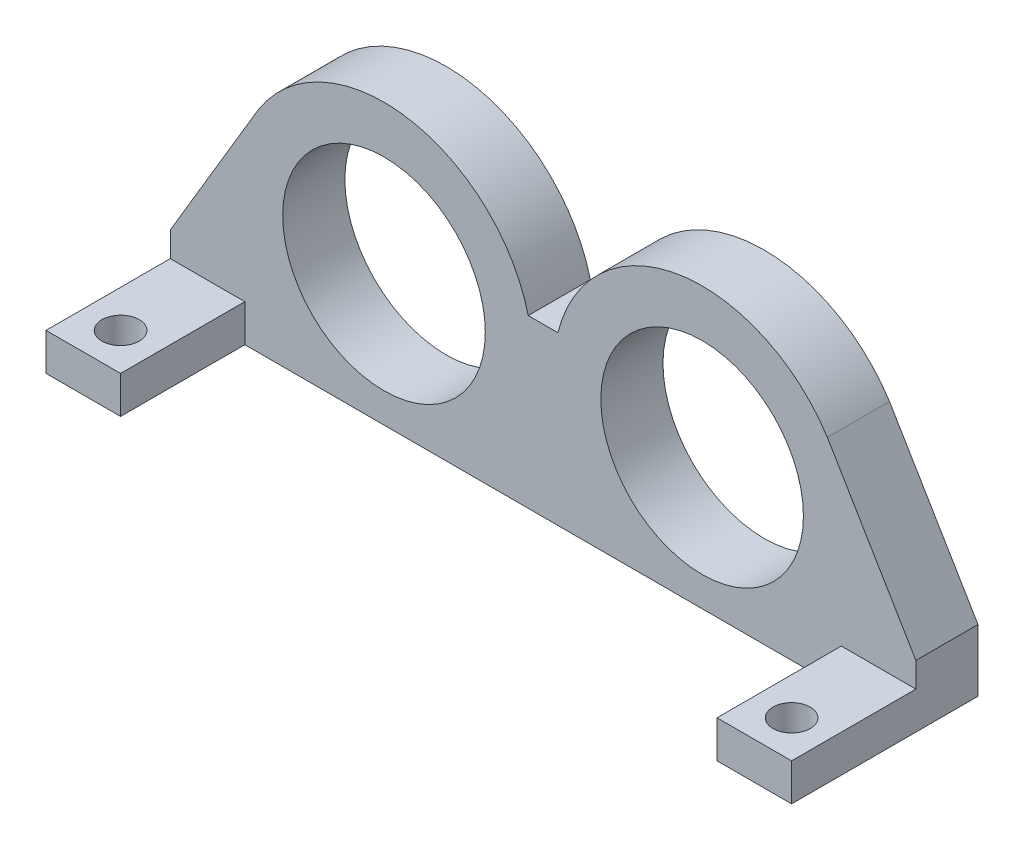
ISO-10303-21;
HEADER;
FILE_DESCRIPTION(('STEP AP214'),'2;1');
FILE_NAME('part.step','',(''),(''),'','','');
FILE_SCHEMA(('AUTOMOTIVE_DESIGN { 1 0 10303 214 1 1 1 1 }'));
ENDSEC;
DATA;
#1=APPLICATION_CONTEXT('core data for automotive mechanical design processes');
#2=APPLICATION_PROTOCOL_DEFINITION('international standard','automotive_design',2000,#1);
#3=PRODUCT_CONTEXT('',#1,'mechanical');
#4=PRODUCT('Part','Part','',(#3));
#5=PRODUCT_RELATED_PRODUCT_CATEGORY('part','',(#4));
#6=PRODUCT_DEFINITION_FORMATION('','',#4);
#7=PRODUCT_DEFINITION_CONTEXT('part definition',#1,'design');
#8=PRODUCT_DEFINITION('design','',#6,#7);
#9=PRODUCT_DEFINITION_SHAPE('','',#8);
#10=(LENGTH_UNIT() NAMED_UNIT(*) SI_UNIT(.MILLI.,.METRE.));
#11=(NAMED_UNIT(*) PLANE_ANGLE_UNIT() SI_UNIT($,.RADIAN.));
#12=(NAMED_UNIT(*) SI_UNIT($,.STERADIAN.) SOLID_ANGLE_UNIT());
#13=UNCERTAINTY_MEASURE_WITH_UNIT(LENGTH_MEASURE(1.E-05),#10,'distance_accuracy_value','');
#14=(GEOMETRIC_REPRESENTATION_CONTEXT(3) GLOBAL_UNCERTAINTY_ASSIGNED_CONTEXT((#13)) GLOBAL_UNIT_ASSIGNED_CONTEXT((#10,
#11,#12)) REPRESENTATION_CONTEXT('',''));
#15=CARTESIAN_POINT('',(0.,0.,0.));
#16=DIRECTION('',(0.,0.,1.));
#17=DIRECTION('',(1.,0.,0.));
#18=AXIS2_PLACEMENT_3D('',#15,#16,#17);
#19=CARTESIAN_POINT('',(-12.8,10.5397331653471,5.));
#20=DIRECTION('',(0.,0.,-1.));
#21=DIRECTION('',(-1.,0.,0.));
#22=AXIS2_PLACEMENT_3D('',#19,#20,#21);
#23=PLANE('',#22);
#24=CARTESIAN_POINT('',(-12.8,10.5397331653471,5.));
#25=DIRECTION('',(0.,0.,1.));
#26=DIRECTION('',(1.,0.,0.));
#27=AXIS2_PLACEMENT_3D('',#24,#25,#26);
#28=CIRCLE('',#27,8.15);
#29=CARTESIAN_POINT('',(-4.65,10.5397331653471,5.));
#30=VERTEX_POINT('',#29);
#31=EDGE_CURVE('E232',#30,#30,#28,.T.);
#32=ORIENTED_EDGE('',*,*,#31,.F.);
#33=EDGE_LOOP('',(#32));
#34=FACE_BOUND('',#33,.T.);
#35=CARTESIAN_POINT('',(12.8,10.5397331653471,5.));
#36=DIRECTION('',(0.,0.,1.));
#37=DIRECTION('',(-1.,0.,0.));
#38=AXIS2_PLACEMENT_3D('',#35,#36,#37);
#39=CIRCLE('',#38,8.15);
#40=CARTESIAN_POINT('',(4.65,10.5397331653471,5.));
#41=VERTEX_POINT('',#40);
#42=EDGE_CURVE('E224',#41,#41,#39,.T.);
#43=ORIENTED_EDGE('',*,*,#42,.F.);
#44=EDGE_LOOP('',(#43));
#45=FACE_BOUND('',#44,.T.);
#46=DIRECTION('',(-1.,0.,0.));
#47=VECTOR('',#46,1.);
#48=CARTESIAN_POINT('',(30.,2.99999999999999,5.));
#49=LINE('',#48,#47);
#50=CARTESIAN_POINT('',(30.,2.99999999999999,5.));
#51=VERTEX_POINT('',#50);
#52=CARTESIAN_POINT('',(24.,2.99999999999999,5.));
#53=VERTEX_POINT('',#52);
#54=EDGE_CURVE('E169',#51,#53,#49,.T.);
#55=ORIENTED_EDGE('',*,*,#54,.F.);
#56=DIRECTION('',(0.,1.,0.));
#57=VECTOR('',#56,1.);
#58=CARTESIAN_POINT('',(30.,0.,5.));
#59=LINE('',#58,#57);
#60=CARTESIAN_POINT('',(30.,5.,5.));
#61=VERTEX_POINT('',#60);
#62=EDGE_CURVE('E246',#51,#61,#59,.T.);
#63=ORIENTED_EDGE('',*,*,#62,.T.);
#64=DIRECTION('',(-0.510895863511002,0.859642609836988,0.));
#65=VECTOR('',#64,1.);
#66=CARTESIAN_POINT('',(30.,5.,5.));
#67=LINE('',#66,#65);
#68=CARTESIAN_POINT('',(22.877190337887,16.9849682188297,5.));
#69=VERTEX_POINT('',#68);
#70=EDGE_CURVE('E249',#61,#69,#67,.T.);
#71=ORIENTED_EDGE('',*,*,#70,.T.);
#72=CARTESIAN_POINT('',(12.8,10.5397331653471,5.));
#73=DIRECTION('',(0.,0.,1.));
#74=DIRECTION('',(1.,0.,0.));
#75=AXIS2_PLACEMENT_3D('',#72,#73,#74);
#76=CIRCLE('',#75,11.9620575153543);
#77=CARTESIAN_POINT('',(1.19334678523513,13.4339379184411,5.));
#78=VERTEX_POINT('',#77);
#79=EDGE_CURVE('E252',#69,#78,#76,.T.);
#80=ORIENTED_EDGE('',*,*,#79,.T.);
#81=DIRECTION('',(-1.,0.,0.));
#82=VECTOR('',#81,1.);
#83=CARTESIAN_POINT('',(-1.19334678523512,13.4339379184411,5.));
#84=LINE('',#83,#82);
#85=CARTESIAN_POINT('',(-1.19334678523512,13.4339379184411,5.));
#86=VERTEX_POINT('',#85);
#87=EDGE_CURVE('E255',#78,#86,#84,.T.);
#88=ORIENTED_EDGE('',*,*,#87,.T.);
#89=CARTESIAN_POINT('',(-12.8,10.5397331653471,5.));
#90=DIRECTION('',(0.,0.,1.));
#91=DIRECTION('',(-1.,0.,0.));
#92=AXIS2_PLACEMENT_3D('',#89,#90,#91);
#93=CIRCLE('',#92,11.9620575153543);
#94=CARTESIAN_POINT('',(-22.877190337887,16.9849682188297,5.));
#95=VERTEX_POINT('',#94);
#96=EDGE_CURVE('E258',#86,#95,#93,.T.);
#97=ORIENTED_EDGE('',*,*,#96,.T.);
#98=DIRECTION('',(-0.510895863511002,-0.859642609836988,0.));
#99=VECTOR('',#98,1.);
#100=CARTESIAN_POINT('',(-30.,4.99999999999999,5.));
#101=LINE('',#100,#99);
#102=CARTESIAN_POINT('',(-30.,4.99999999999999,5.));
#103=VERTEX_POINT('',#102);
#104=EDGE_CURVE('E261',#95,#103,#101,.T.);
#105=ORIENTED_EDGE('',*,*,#104,.T.);
#106=DIRECTION('',(0.,-1.,0.));
#107=VECTOR('',#106,1.);
#108=CARTESIAN_POINT('',(-30.,0.,5.));
#109=LINE('',#108,#107);
#110=CARTESIAN_POINT('',(-30.,2.99999999999999,5.));
#111=VERTEX_POINT('',#110);
#112=EDGE_CURVE('E240',#103,#111,#109,.T.);
#113=ORIENTED_EDGE('',*,*,#112,.T.);
#114=DIRECTION('',(-1.,0.,0.));
#115=VECTOR('',#114,1.);
#116=CARTESIAN_POINT('',(-30.,2.99999999999999,5.));
#117=LINE('',#116,#115);
#118=CARTESIAN_POINT('',(-24.,2.99999999999999,5.));
#119=VERTEX_POINT('',#118);
#120=EDGE_CURVE('E196',#119,#111,#117,.T.);
#121=ORIENTED_EDGE('',*,*,#120,.F.);
#122=DIRECTION('',(0.,1.,0.));
#123=VECTOR('',#122,1.);
#124=CARTESIAN_POINT('',(-24.,0.,5.));
#125=LINE('',#124,#123);
#126=CARTESIAN_POINT('',(-24.,0.,5.));
#127=VERTEX_POINT('',#126);
#128=EDGE_CURVE('E190',#127,#119,#125,.T.);
#129=ORIENTED_EDGE('',*,*,#128,.F.);
#130=DIRECTION('',(1.,0.,0.));
#131=VECTOR('',#130,1.);
#132=CARTESIAN_POINT('',(30.,0.,5.));
#133=LINE('',#132,#131);
#134=CARTESIAN_POINT('',(24.,0.,5.));
#135=VERTEX_POINT('',#134);
#136=EDGE_CURVE('E62',#127,#135,#133,.T.);
#137=ORIENTED_EDGE('',*,*,#136,.T.);
#138=DIRECTION('',(0.,-1.,0.));
#139=VECTOR('',#138,1.);
#140=CARTESIAN_POINT('',(24.,0.,5.));
#141=LINE('',#140,#139);
#142=EDGE_CURVE('E57',#53,#135,#141,.T.);
#143=ORIENTED_EDGE('',*,*,#142,.F.);
#144=EDGE_LOOP('',(#55,#63,#71,#80,#88,#97,#105,#113,#121,#129,#137,#143));
#145=FACE_BOUND('',#144,.T.);
#146=ADVANCED_FACE('F41',(#34,#45,#145),#23,.F.);
#147=CARTESIAN_POINT('',(-12.8,10.5397331653471,0.));
#148=DIRECTION('',(0.,0.,-1.));
#149=DIRECTION('',(-1.,0.,0.));
#150=AXIS2_PLACEMENT_3D('',#147,#148,#149);
#151=PLANE('',#150);
#152=CARTESIAN_POINT('',(-12.8,10.5397331653471,0.));
#153=DIRECTION('',(0.,0.,1.));
#154=DIRECTION('',(1.,0.,0.));
#155=AXIS2_PLACEMENT_3D('',#152,#153,#154);
#156=CIRCLE('',#155,8.15);
#157=CARTESIAN_POINT('',(-4.65,10.5397331653471,0.));
#158=VERTEX_POINT('',#157);
#159=EDGE_CURVE('E228',#158,#158,#156,.T.);
#160=ORIENTED_EDGE('',*,*,#159,.T.);
#161=EDGE_LOOP('',(#160));
#162=FACE_BOUND('',#161,.T.);
#163=DIRECTION('',(0.,-1.,0.));
#164=VECTOR('',#163,1.);
#165=CARTESIAN_POINT('',(-30.,0.,0.));
#166=LINE('',#165,#164);
#167=CARTESIAN_POINT('',(-30.,4.99999999999999,0.));
#168=VERTEX_POINT('',#167);
#169=CARTESIAN_POINT('',(-30.,0.,0.));
#170=VERTEX_POINT('',#169);
#171=EDGE_CURVE('E236',#168,#170,#166,.T.);
#172=ORIENTED_EDGE('',*,*,#171,.F.);
#173=DIRECTION('',(-0.510895863511002,-0.859642609836988,0.));
#174=VECTOR('',#173,1.);
#175=CARTESIAN_POINT('',(-30.,4.99999999999999,0.));
#176=LINE('',#175,#174);
#177=CARTESIAN_POINT('',(-22.877190337887,16.9849682188297,0.));
#178=VERTEX_POINT('',#177);
#179=EDGE_CURVE('E243',#178,#168,#176,.T.);
#180=ORIENTED_EDGE('',*,*,#179,.F.);
#181=CARTESIAN_POINT('',(-12.8,10.5397331653471,0.));
#182=DIRECTION('',(0.,0.,1.));
#183=DIRECTION('',(-1.,0.,0.));
#184=AXIS2_PLACEMENT_3D('',#181,#182,#183);
#185=CIRCLE('',#184,11.9620575153543);
#186=CARTESIAN_POINT('',(-1.19334678523512,13.4339379184411,0.));
#187=VERTEX_POINT('',#186);
#188=EDGE_CURVE('E282',#187,#178,#185,.T.);
#189=ORIENTED_EDGE('',*,*,#188,.F.);
#190=DIRECTION('',(-1.,0.,0.));
#191=VECTOR('',#190,1.);
#192=CARTESIAN_POINT('',(-1.19334678523512,13.4339379184411,0.));
#193=LINE('',#192,#191);
#194=CARTESIAN_POINT('',(1.19334678523513,13.4339379184411,0.));
#195=VERTEX_POINT('',#194);
#196=EDGE_CURVE('E279',#195,#187,#193,.T.);
#197=ORIENTED_EDGE('',*,*,#196,.F.);
#198=CARTESIAN_POINT('',(12.8,10.5397331653471,0.));
#199=DIRECTION('',(0.,0.,1.));
#200=DIRECTION('',(1.,0.,0.));
#201=AXIS2_PLACEMENT_3D('',#198,#199,#200);
#202=CIRCLE('',#201,11.9620575153543);
#203=CARTESIAN_POINT('',(22.877190337887,16.9849682188297,0.));
#204=VERTEX_POINT('',#203);
#205=EDGE_CURVE('E276',#204,#195,#202,.T.);
#206=ORIENTED_EDGE('',*,*,#205,.F.);
#207=DIRECTION('',(-0.510895863511002,0.859642609836988,0.));
#208=VECTOR('',#207,1.);
#209=CARTESIAN_POINT('',(30.,5.,0.));
#210=LINE('',#209,#208);
#211=CARTESIAN_POINT('',(30.,5.,0.));
#212=VERTEX_POINT('',#211);
#213=EDGE_CURVE('E273',#212,#204,#210,.T.);
#214=ORIENTED_EDGE('',*,*,#213,.F.);
#215=DIRECTION('',(0.,1.,0.));
#216=VECTOR('',#215,1.);
#217=CARTESIAN_POINT('',(30.,0.,0.));
#218=LINE('',#217,#216);
#219=CARTESIAN_POINT('',(30.,0.,0.));
#220=VERTEX_POINT('',#219);
#221=EDGE_CURVE('E270',#220,#212,#218,.T.);
#222=ORIENTED_EDGE('',*,*,#221,.F.);
#223=DIRECTION('',(1.,0.,0.));
#224=VECTOR('',#223,1.);
#225=CARTESIAN_POINT('',(30.,0.,0.));
#226=LINE('',#225,#224);
#227=EDGE_CURVE('E147',#170,#220,#226,.T.);
#228=ORIENTED_EDGE('',*,*,#227,.F.);
#229=EDGE_LOOP('',(#172,#180,#189,#197,#206,#214,#222,#228));
#230=FACE_BOUND('',#229,.T.);
#231=CARTESIAN_POINT('',(12.8,10.5397331653471,0.));
#232=DIRECTION('',(0.,0.,1.));
#233=DIRECTION('',(-1.,0.,0.));
#234=AXIS2_PLACEMENT_3D('',#231,#232,#233);
#235=CIRCLE('',#234,8.15);
#236=CARTESIAN_POINT('',(4.65,10.5397331653471,0.));
#237=VERTEX_POINT('',#236);
#238=EDGE_CURVE('E223',#237,#237,#235,.T.);
#239=ORIENTED_EDGE('',*,*,#238,.T.);
#240=EDGE_LOOP('',(#239));
#241=FACE_BOUND('',#240,.T.);
#242=ADVANCED_FACE('F317',(#162,#230,#241),#151,.T.);
#243=CARTESIAN_POINT('',(-30.,0.,5.));
#244=DIRECTION('',(1.,0.,0.));
#245=DIRECTION('',(0.,1.,0.));
#246=AXIS2_PLACEMENT_3D('',#243,#244,#245);
#247=PLANE('',#246);
#248=ORIENTED_EDGE('',*,*,#171,.T.);
#249=DIRECTION('',(0.,0.,-1.));
#250=VECTOR('',#249,1.);
#251=CARTESIAN_POINT('',(-30.,0.,5.));
#252=LINE('',#251,#250);
#253=CARTESIAN_POINT('',(-30.,0.,15.));
#254=VERTEX_POINT('',#253);
#255=EDGE_CURVE('E11',#254,#170,#252,.T.);
#256=ORIENTED_EDGE('',*,*,#255,.F.);
#257=DIRECTION('',(0.,-1.,0.));
#258=VECTOR('',#257,1.);
#259=CARTESIAN_POINT('',(-30.,0.,15.));
#260=LINE('',#259,#258);
#261=CARTESIAN_POINT('',(-30.,2.99999999999999,15.));
#262=VERTEX_POINT('',#261);
#263=EDGE_CURVE('E191',#262,#254,#260,.T.);
#264=ORIENTED_EDGE('',*,*,#263,.F.);
#265=DIRECTION('',(0.,0.,-1.));
#266=VECTOR('',#265,1.);
#267=CARTESIAN_POINT('',(-30.,2.99999999999999,15.));
#268=LINE('',#267,#266);
#269=EDGE_CURVE('E205',#262,#111,#268,.T.);
#270=ORIENTED_EDGE('',*,*,#269,.T.);
#271=ORIENTED_EDGE('',*,*,#112,.F.);
#272=DIRECTION('',(0.,0.,-1.));
#273=VECTOR('',#272,1.);
#274=CARTESIAN_POINT('',(-30.,4.99999999999999,5.));
#275=LINE('',#274,#273);
#276=EDGE_CURVE('E264',#103,#168,#275,.T.);
#277=ORIENTED_EDGE('',*,*,#276,.T.);
#278=EDGE_LOOP('',(#248,#256,#264,#270,#271,#277));
#279=FACE_BOUND('',#278,.T.);
#280=ADVANCED_FACE('F43',(#279),#247,.F.);
#281=CARTESIAN_POINT('',(30.,0.,5.));
#282=DIRECTION('',(0.,1.,0.));
#283=DIRECTION('',(-1.,0.,0.));
#284=AXIS2_PLACEMENT_3D('',#281,#282,#283);
#285=PLANE('',#284);
#286=CARTESIAN_POINT('',(-27.,0.,12.));
#287=DIRECTION('',(0.,1.,0.));
#288=DIRECTION('',(-1.,0.,0.));
#289=AXIS2_PLACEMENT_3D('',#286,#287,#288);
#290=CIRCLE('',#289,1.5);
#291=CARTESIAN_POINT('',(-28.5,0.,12.));
#292=VERTEX_POINT('',#291);
#293=EDGE_CURVE('E172',#292,#292,#290,.T.);
#294=ORIENTED_EDGE('',*,*,#293,.T.);
#295=EDGE_LOOP('',(#294));
#296=FACE_BOUND('',#295,.T.);
#297=CARTESIAN_POINT('',(27.,0.,12.));
#298=DIRECTION('',(0.,1.,0.));
#299=DIRECTION('',(-1.,0.,0.));
#300=AXIS2_PLACEMENT_3D('',#297,#298,#299);
#301=CIRCLE('',#300,1.5);
#302=CARTESIAN_POINT('',(25.5,0.,12.));
#303=VERTEX_POINT('',#302);
#304=EDGE_CURVE('E415',#303,#303,#301,.T.);
#305=ORIENTED_EDGE('',*,*,#304,.T.);
#306=EDGE_LOOP('',(#305));
#307=FACE_BOUND('',#306,.T.);
#308=ORIENTED_EDGE('',*,*,#227,.T.);
#309=DIRECTION('',(0.,0.,-1.));
#310=VECTOR('',#309,1.);
#311=CARTESIAN_POINT('',(30.,0.,5.));
#312=LINE('',#311,#310);
#313=CARTESIAN_POINT('',(30.,0.,15.));
#314=VERTEX_POINT('',#313);
#315=EDGE_CURVE('E50',#314,#220,#312,.T.);
#316=ORIENTED_EDGE('',*,*,#315,.F.);
#317=DIRECTION('',(1.,0.,0.));
#318=VECTOR('',#317,1.);
#319=CARTESIAN_POINT('',(30.,0.,15.));
#320=LINE('',#319,#318);
#321=CARTESIAN_POINT('',(24.,0.,15.));
#322=VERTEX_POINT('',#321);
#323=EDGE_CURVE('E146',#322,#314,#320,.T.);
#324=ORIENTED_EDGE('',*,*,#323,.F.);
#325=DIRECTION('',(0.,0.,-1.));
#326=VECTOR('',#325,1.);
#327=CARTESIAN_POINT('',(24.,0.,15.));
#328=LINE('',#327,#326);
#329=EDGE_CURVE('E179',#322,#135,#328,.T.);
#330=ORIENTED_EDGE('',*,*,#329,.T.);
#331=ORIENTED_EDGE('',*,*,#136,.F.);
#332=DIRECTION('',(0.,0.,-1.));
#333=VECTOR('',#332,1.);
#334=CARTESIAN_POINT('',(-24.,0.,15.));
#335=LINE('',#334,#333);
#336=CARTESIAN_POINT('',(-24.,0.,15.));
#337=VERTEX_POINT('',#336);
#338=EDGE_CURVE('E219',#337,#127,#335,.T.);
#339=ORIENTED_EDGE('',*,*,#338,.F.);
#340=DIRECTION('',(1.,0.,0.));
#341=VECTOR('',#340,1.);
#342=CARTESIAN_POINT('',(-30.,0.,15.));
#343=LINE('',#342,#341);
#344=EDGE_CURVE('E195',#254,#337,#343,.T.);
#345=ORIENTED_EDGE('',*,*,#344,.F.);
#346=ORIENTED_EDGE('',*,*,#255,.T.);
#347=EDGE_LOOP('',(#308,#316,#324,#330,#331,#339,#345,#346));
#348=FACE_BOUND('',#347,.T.);
#349=ADVANCED_FACE('F143',(#296,#307,#348),#285,.F.);
#350=CARTESIAN_POINT('',(30.,0.,5.));
#351=DIRECTION('',(-1.,0.,0.));
#352=DIRECTION('',(0.,-1.,0.));
#353=AXIS2_PLACEMENT_3D('',#350,#351,#352);
#354=PLANE('',#353);
#355=ORIENTED_EDGE('',*,*,#221,.T.);
#356=DIRECTION('',(0.,0.,-1.));
#357=VECTOR('',#356,1.);
#358=CARTESIAN_POINT('',(30.,5.,5.));
#359=LINE('',#358,#357);
#360=EDGE_CURVE('E151',#61,#212,#359,.T.);
#361=ORIENTED_EDGE('',*,*,#360,.F.);
#362=ORIENTED_EDGE('',*,*,#62,.F.);
#363=DIRECTION('',(0.,0.,-1.));
#364=VECTOR('',#363,1.);
#365=CARTESIAN_POINT('',(30.,2.99999999999999,15.));
#366=LINE('',#365,#364);
#367=CARTESIAN_POINT('',(30.,2.99999999999999,15.));
#368=VERTEX_POINT('',#367);
#369=EDGE_CURVE('E156',#368,#51,#366,.T.);
#370=ORIENTED_EDGE('',*,*,#369,.F.);
#371=DIRECTION('',(0.,1.,0.));
#372=VECTOR('',#371,1.);
#373=CARTESIAN_POINT('',(30.,0.,15.));
#374=LINE('',#373,#372);
#375=EDGE_CURVE('E153',#314,#368,#374,.T.);
#376=ORIENTED_EDGE('',*,*,#375,.F.);
#377=ORIENTED_EDGE('',*,*,#315,.T.);
#378=EDGE_LOOP('',(#355,#361,#362,#370,#376,#377));
#379=FACE_BOUND('',#378,.T.);
#380=ADVANCED_FACE('F154',(#379),#354,.F.);
#381=CARTESIAN_POINT('',(30.,5.,5.));
#382=DIRECTION('',(-0.859642609836988,-0.510895863511002,0.));
#383=DIRECTION('',(0.510895863511002,-0.859642609836988,0.));
#384=AXIS2_PLACEMENT_3D('',#381,#382,#383);
#385=PLANE('',#384);
#386=ORIENTED_EDGE('',*,*,#213,.T.);
#387=DIRECTION('',(0.,0.,-1.));
#388=VECTOR('',#387,1.);
#389=CARTESIAN_POINT('',(22.877190337887,16.9849682188297,5.));
#390=LINE('',#389,#388);
#391=EDGE_CURVE('E302',#69,#204,#390,.T.);
#392=ORIENTED_EDGE('',*,*,#391,.F.);
#393=ORIENTED_EDGE('',*,*,#70,.F.);
#394=ORIENTED_EDGE('',*,*,#360,.T.);
#395=EDGE_LOOP('',(#386,#392,#393,#394));
#396=FACE_BOUND('',#395,.T.);
#397=ADVANCED_FACE('F312',(#396),#385,.F.);
#398=CARTESIAN_POINT('',(12.8,10.5397331653471,5.));
#399=DIRECTION('',(0.,0.,-1.));
#400=DIRECTION('',(-1.,0.,0.));
#401=AXIS2_PLACEMENT_3D('',#398,#399,#400);
#402=CYLINDRICAL_SURFACE('',#401,11.9620575153543);
#403=ORIENTED_EDGE('',*,*,#205,.T.);
#404=DIRECTION('',(0.,0.,-1.));
#405=VECTOR('',#404,1.);
#406=CARTESIAN_POINT('',(1.19334678523513,13.4339379184411,5.));
#407=LINE('',#406,#405);
#408=EDGE_CURVE('E298',#78,#195,#407,.T.);
#409=ORIENTED_EDGE('',*,*,#408,.F.);
#410=ORIENTED_EDGE('',*,*,#79,.F.);
#411=ORIENTED_EDGE('',*,*,#391,.T.);
#412=EDGE_LOOP('',(#403,#409,#410,#411));
#413=FACE_BOUND('',#412,.T.);
#414=ADVANCED_FACE('F323',(#413),#402,.T.);
#415=CARTESIAN_POINT('',(-1.19334678523512,13.4339379184411,5.));
#416=DIRECTION('',(0.,-1.,0.));
#417=DIRECTION('',(0.,0.,-1.));
#418=AXIS2_PLACEMENT_3D('',#415,#416,#417);
#419=PLANE('',#418);
#420=ORIENTED_EDGE('',*,*,#196,.T.);
#421=DIRECTION('',(0.,0.,-1.));
#422=VECTOR('',#421,1.);
#423=CARTESIAN_POINT('',(-1.19334678523512,13.4339379184411,5.));
#424=LINE('',#423,#422);
#425=EDGE_CURVE('E294',#86,#187,#424,.T.);
#426=ORIENTED_EDGE('',*,*,#425,.F.);
#427=ORIENTED_EDGE('',*,*,#87,.F.);
#428=ORIENTED_EDGE('',*,*,#408,.T.);
#429=EDGE_LOOP('',(#420,#426,#427,#428));
#430=FACE_BOUND('',#429,.T.);
#431=ADVANCED_FACE('F327',(#430),#419,.F.);
#432=CARTESIAN_POINT('',(-12.8,10.5397331653471,5.));
#433=DIRECTION('',(0.,0.,-1.));
#434=DIRECTION('',(-1.,0.,0.));
#435=AXIS2_PLACEMENT_3D('',#432,#433,#434);
#436=CYLINDRICAL_SURFACE('',#435,11.9620575153543);
#437=ORIENTED_EDGE('',*,*,#188,.T.);
#438=DIRECTION('',(0.,0.,-1.));
#439=VECTOR('',#438,1.);
#440=CARTESIAN_POINT('',(-22.877190337887,16.9849682188297,5.));
#441=LINE('',#440,#439);
#442=EDGE_CURVE('E290',#95,#178,#441,.T.);
#443=ORIENTED_EDGE('',*,*,#442,.F.);
#444=ORIENTED_EDGE('',*,*,#96,.F.);
#445=ORIENTED_EDGE('',*,*,#425,.T.);
#446=EDGE_LOOP('',(#437,#443,#444,#445));
#447=FACE_BOUND('',#446,.T.);
#448=ADVANCED_FACE('F355',(#447),#436,.T.);
#449=CARTESIAN_POINT('',(-30.,4.99999999999999,5.));
#450=DIRECTION('',(0.859642609836988,-0.510895863511002,0.));
#451=DIRECTION('',(0.510895863511002,0.859642609836988,0.));
#452=AXIS2_PLACEMENT_3D('',#449,#450,#451);
#453=PLANE('',#452);
#454=ORIENTED_EDGE('',*,*,#179,.T.);
#455=ORIENTED_EDGE('',*,*,#276,.F.);
#456=ORIENTED_EDGE('',*,*,#104,.F.);
#457=ORIENTED_EDGE('',*,*,#442,.T.);
#458=EDGE_LOOP('',(#454,#455,#456,#457));
#459=FACE_BOUND('',#458,.T.);
#460=ADVANCED_FACE('F352',(#459),#453,.F.);
#461=CARTESIAN_POINT('',(-12.8,10.5397331653471,5.));
#462=DIRECTION('',(0.,0.,-1.));
#463=DIRECTION('',(-1.,0.,0.));
#464=AXIS2_PLACEMENT_3D('',#461,#462,#463);
#465=CYLINDRICAL_SURFACE('',#464,8.15);
#466=ORIENTED_EDGE('',*,*,#31,.T.);
#467=EDGE_LOOP('',(#466));
#468=FACE_BOUND('',#467,.T.);
#469=ORIENTED_EDGE('',*,*,#159,.F.);
#470=EDGE_LOOP('',(#469));
#471=FACE_BOUND('',#470,.T.);
#472=ADVANCED_FACE('F362',(#468,#471),#465,.F.);
#473=CARTESIAN_POINT('',(12.8,10.5397331653471,5.));
#474=DIRECTION('',(0.,0.,-1.));
#475=DIRECTION('',(-1.,0.,0.));
#476=AXIS2_PLACEMENT_3D('',#473,#474,#475);
#477=CYLINDRICAL_SURFACE('',#476,8.15);
#478=ORIENTED_EDGE('',*,*,#42,.T.);
#479=EDGE_LOOP('',(#478));
#480=FACE_BOUND('',#479,.T.);
#481=ORIENTED_EDGE('',*,*,#238,.F.);
#482=EDGE_LOOP('',(#481));
#483=FACE_BOUND('',#482,.T.);
#484=ADVANCED_FACE('F378',(#480,#483),#477,.F.);
#485=CARTESIAN_POINT('',(-24.,0.,15.));
#486=DIRECTION('',(-1.,0.,0.));
#487=DIRECTION('',(0.,0.,1.));
#488=AXIS2_PLACEMENT_3D('',#485,#486,#487);
#489=PLANE('',#488);
#490=ORIENTED_EDGE('',*,*,#128,.T.);
#491=DIRECTION('',(0.,0.,-1.));
#492=VECTOR('',#491,1.);
#493=CARTESIAN_POINT('',(-24.,2.99999999999999,15.));
#494=LINE('',#493,#492);
#495=CARTESIAN_POINT('',(-24.,2.99999999999999,15.));
#496=VERTEX_POINT('',#495);
#497=EDGE_CURVE('E215',#496,#119,#494,.T.);
#498=ORIENTED_EDGE('',*,*,#497,.F.);
#499=DIRECTION('',(0.,1.,0.));
#500=VECTOR('',#499,1.);
#501=CARTESIAN_POINT('',(-24.,0.,15.));
#502=LINE('',#501,#500);
#503=EDGE_CURVE('E199',#337,#496,#502,.T.);
#504=ORIENTED_EDGE('',*,*,#503,.F.);
#505=ORIENTED_EDGE('',*,*,#338,.T.);
#506=EDGE_LOOP('',(#490,#498,#504,#505));
#507=FACE_BOUND('',#506,.T.);
#508=ADVANCED_FACE('F340',(#507),#489,.F.);
#509=CARTESIAN_POINT('',(-30.,2.99999999999999,15.));
#510=DIRECTION('',(0.,-1.,0.));
#511=DIRECTION('',(0.,0.,-1.));
#512=AXIS2_PLACEMENT_3D('',#509,#510,#511);
#513=PLANE('',#512);
#514=CARTESIAN_POINT('',(-27.,2.99999999999999,12.));
#515=DIRECTION('',(0.,1.,0.));
#516=DIRECTION('',(0.,0.,1.));
#517=AXIS2_PLACEMENT_3D('',#514,#515,#516);
#518=CIRCLE('',#517,1.5);
#519=CARTESIAN_POINT('',(-27.,2.99999999999999,13.5));
#520=VERTEX_POINT('',#519);
#521=EDGE_CURVE('E410',#520,#520,#518,.T.);
#522=ORIENTED_EDGE('',*,*,#521,.F.);
#523=EDGE_LOOP('',(#522));
#524=FACE_BOUND('',#523,.T.);
#525=ORIENTED_EDGE('',*,*,#120,.T.);
#526=ORIENTED_EDGE('',*,*,#269,.F.);
#527=DIRECTION('',(-1.,0.,0.));
#528=VECTOR('',#527,1.);
#529=CARTESIAN_POINT('',(-30.,2.99999999999999,15.));
#530=LINE('',#529,#528);
#531=EDGE_CURVE('E202',#496,#262,#530,.T.);
#532=ORIENTED_EDGE('',*,*,#531,.F.);
#533=ORIENTED_EDGE('',*,*,#497,.T.);
#534=EDGE_LOOP('',(#525,#526,#532,#533));
#535=FACE_BOUND('',#534,.T.);
#536=ADVANCED_FACE('F385',(#524,#535),#513,.F.);
#537=CARTESIAN_POINT('',(0.,0.,15.));
#538=DIRECTION('',(0.,0.,-1.));
#539=DIRECTION('',(-1.,0.,0.));
#540=AXIS2_PLACEMENT_3D('',#537,#538,#539);
#541=PLANE('',#540);
#542=ORIENTED_EDGE('',*,*,#263,.T.);
#543=ORIENTED_EDGE('',*,*,#344,.T.);
#544=ORIENTED_EDGE('',*,*,#503,.T.);
#545=ORIENTED_EDGE('',*,*,#531,.T.);
#546=EDGE_LOOP('',(#542,#543,#544,#545));
#547=FACE_BOUND('',#546,.T.);
#548=ADVANCED_FACE('F344',(#547),#541,.F.);
#549=CARTESIAN_POINT('',(30.,2.99999999999999,15.));
#550=DIRECTION('',(0.,-1.,0.));
#551=DIRECTION('',(0.,0.,-1.));
#552=AXIS2_PLACEMENT_3D('',#549,#550,#551);
#553=PLANE('',#552);
#554=CARTESIAN_POINT('',(27.,2.99999999999999,12.));
#555=DIRECTION('',(0.,1.,0.));
#556=DIRECTION('',(0.,0.,1.));
#557=AXIS2_PLACEMENT_3D('',#554,#555,#556);
#558=CIRCLE('',#557,1.5);
#559=CARTESIAN_POINT('',(27.,2.99999999999999,13.5));
#560=VERTEX_POINT('',#559);
#561=EDGE_CURVE('E421',#560,#560,#558,.T.);
#562=ORIENTED_EDGE('',*,*,#561,.F.);
#563=EDGE_LOOP('',(#562));
#564=FACE_BOUND('',#563,.T.);
#565=ORIENTED_EDGE('',*,*,#54,.T.);
#566=DIRECTION('',(0.,0.,-1.));
#567=VECTOR('',#566,1.);
#568=CARTESIAN_POINT('',(24.,2.99999999999999,15.));
#569=LINE('',#568,#567);
#570=CARTESIAN_POINT('',(24.,2.99999999999999,15.));
#571=VERTEX_POINT('',#570);
#572=EDGE_CURVE('E184',#571,#53,#569,.T.);
#573=ORIENTED_EDGE('',*,*,#572,.F.);
#574=DIRECTION('',(-1.,0.,0.));
#575=VECTOR('',#574,1.);
#576=CARTESIAN_POINT('',(30.,2.99999999999999,15.));
#577=LINE('',#576,#575);
#578=EDGE_CURVE('E160',#368,#571,#577,.T.);
#579=ORIENTED_EDGE('',*,*,#578,.F.);
#580=ORIENTED_EDGE('',*,*,#369,.T.);
#581=EDGE_LOOP('',(#565,#573,#579,#580));
#582=FACE_BOUND('',#581,.T.);
#583=ADVANCED_FACE('F333',(#564,#582),#553,.F.);
#584=CARTESIAN_POINT('',(24.,0.,15.));
#585=DIRECTION('',(1.,0.,0.));
#586=DIRECTION('',(0.,0.,-1.));
#587=AXIS2_PLACEMENT_3D('',#584,#585,#586);
#588=PLANE('',#587);
#589=ORIENTED_EDGE('',*,*,#142,.T.);
#590=ORIENTED_EDGE('',*,*,#329,.F.);
#591=DIRECTION('',(0.,-1.,0.));
#592=VECTOR('',#591,1.);
#593=CARTESIAN_POINT('',(24.,0.,15.));
#594=LINE('',#593,#592);
#595=EDGE_CURVE('E164',#571,#322,#594,.T.);
#596=ORIENTED_EDGE('',*,*,#595,.F.);
#597=ORIENTED_EDGE('',*,*,#572,.T.);
#598=EDGE_LOOP('',(#589,#590,#596,#597));
#599=FACE_BOUND('',#598,.T.);
#600=ADVANCED_FACE('F335',(#599),#588,.F.);
#601=CARTESIAN_POINT('',(0.,0.,15.));
#602=DIRECTION('',(0.,0.,-1.));
#603=DIRECTION('',(-1.,0.,0.));
#604=AXIS2_PLACEMENT_3D('',#601,#602,#603);
#605=PLANE('',#604);
#606=ORIENTED_EDGE('',*,*,#323,.T.);
#607=ORIENTED_EDGE('',*,*,#375,.T.);
#608=ORIENTED_EDGE('',*,*,#578,.T.);
#609=ORIENTED_EDGE('',*,*,#595,.T.);
#610=EDGE_LOOP('',(#606,#607,#608,#609));
#611=FACE_BOUND('',#610,.T.);
#612=ADVANCED_FACE('F162',(#611),#605,.F.);
#613=CARTESIAN_POINT('',(27.,-7.00000000000001,12.));
#614=DIRECTION('',(0.,1.,0.));
#615=DIRECTION('',(0.,0.,1.));
#616=AXIS2_PLACEMENT_3D('',#613,#614,#615);
#617=CYLINDRICAL_SURFACE('',#616,1.5);
#618=ORIENTED_EDGE('',*,*,#561,.T.);
#619=EDGE_LOOP('',(#618));
#620=FACE_BOUND('',#619,.T.);
#621=ORIENTED_EDGE('',*,*,#304,.F.);
#622=EDGE_LOOP('',(#621));
#623=FACE_BOUND('',#622,.T.);
#624=ADVANCED_FACE('F398',(#620,#623),#617,.F.);
#625=CARTESIAN_POINT('',(-27.,-7.00000000000001,12.));
#626=DIRECTION('',(0.,1.,0.));
#627=DIRECTION('',(0.,0.,1.));
#628=AXIS2_PLACEMENT_3D('',#625,#626,#627);
#629=CYLINDRICAL_SURFACE('',#628,1.5);
#630=ORIENTED_EDGE('',*,*,#521,.T.);
#631=EDGE_LOOP('',(#630));
#632=FACE_BOUND('',#631,.T.);
#633=ORIENTED_EDGE('',*,*,#293,.F.);
#634=EDGE_LOOP('',(#633));
#635=FACE_BOUND('',#634,.T.);
#636=ADVANCED_FACE('F401',(#632,#635),#629,.F.);
#637=CLOSED_SHELL('',(#146,#242,#280,#349,#380,#397,#414,#431,#448,#460,#472,#484,#508,#536,
#548,#583,#600,#612,#624,#636));
#638=MANIFOLD_SOLID_BREP('B2',#637);
#639=ADVANCED_BREP_SHAPE_REPRESENTATION('',(#18,#638),#14);
#640=SHAPE_DEFINITION_REPRESENTATION(#9,#639);
ENDSEC;
END-ISO-10303-21;
